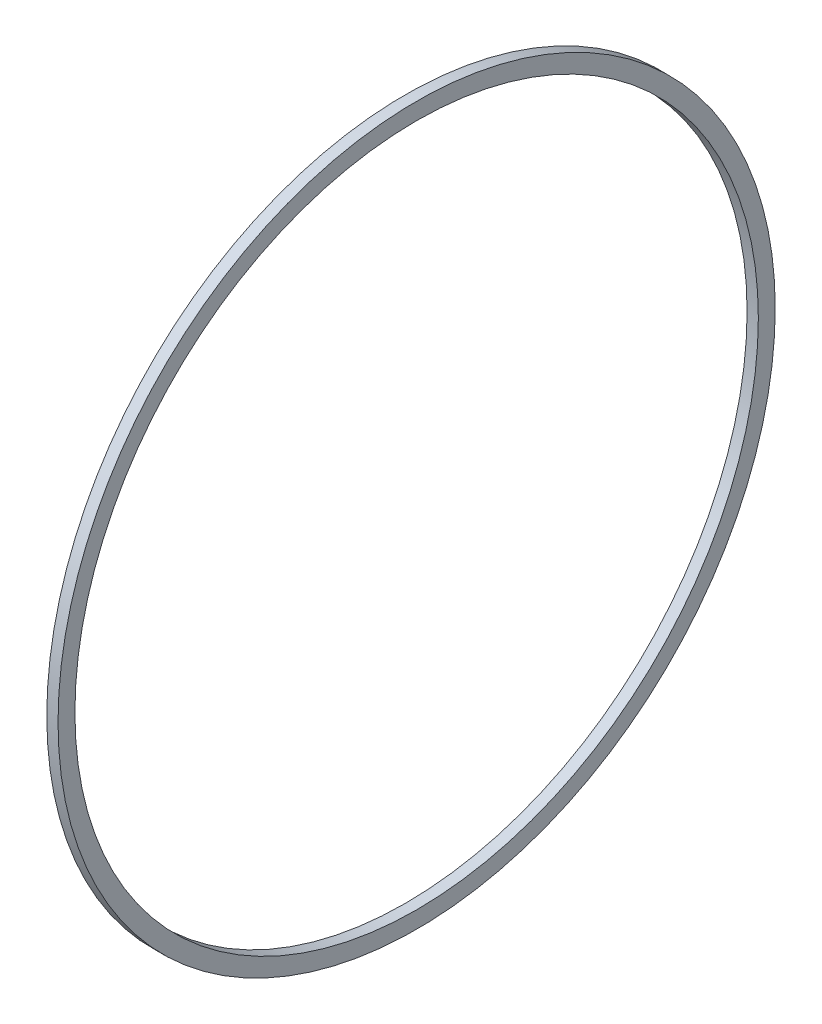
ISO-10303-21;
HEADER;
FILE_DESCRIPTION(('STEP AP214'),'2;1');
FILE_NAME('part.step','',(''),(''),'','','');
FILE_SCHEMA(('AUTOMOTIVE_DESIGN { 1 0 10303 214 1 1 1 1 }'));
ENDSEC;
DATA;
#1=APPLICATION_CONTEXT('core data for automotive mechanical design processes');
#2=APPLICATION_PROTOCOL_DEFINITION('international standard','automotive_design',2000,#1);
#3=PRODUCT_CONTEXT('',#1,'mechanical');
#4=PRODUCT('Part','Part','',(#3));
#5=PRODUCT_RELATED_PRODUCT_CATEGORY('part','',(#4));
#6=PRODUCT_DEFINITION_FORMATION('','',#4);
#7=PRODUCT_DEFINITION_CONTEXT('part definition',#1,'design');
#8=PRODUCT_DEFINITION('design','',#6,#7);
#9=PRODUCT_DEFINITION_SHAPE('','',#8);
#10=(LENGTH_UNIT() NAMED_UNIT(*) SI_UNIT(.MILLI.,.METRE.));
#11=(NAMED_UNIT(*) PLANE_ANGLE_UNIT() SI_UNIT($,.RADIAN.));
#12=(NAMED_UNIT(*) SI_UNIT($,.STERADIAN.) SOLID_ANGLE_UNIT());
#13=UNCERTAINTY_MEASURE_WITH_UNIT(LENGTH_MEASURE(1.E-05),#10,'distance_accuracy_value','');
#14=(GEOMETRIC_REPRESENTATION_CONTEXT(3) GLOBAL_UNCERTAINTY_ASSIGNED_CONTEXT((#13)) GLOBAL_UNIT_ASSIGNED_CONTEXT((#10,
#11,#12)) REPRESENTATION_CONTEXT('',''));
#15=CARTESIAN_POINT('',(0.,0.,0.));
#16=DIRECTION('',(0.,0.,1.));
#17=DIRECTION('',(1.,0.,0.));
#18=AXIS2_PLACEMENT_3D('',#15,#16,#17);
#19=CARTESIAN_POINT('',(2.,0.,0.));
#20=DIRECTION('',(1.,0.,0.));
#21=DIRECTION('',(0.,0.,-1.));
#22=AXIS2_PLACEMENT_3D('',#19,#20,#21);
#23=PLANE('',#22);
#24=CARTESIAN_POINT('',(2.,0.,0.));
#25=DIRECTION('',(1.,0.,0.));
#26=DIRECTION('',(0.,0.,-1.));
#27=AXIS2_PLACEMENT_3D('',#24,#25,#26);
#28=CIRCLE('',#27,63.75);
#29=CARTESIAN_POINT('',(2.,0.,-63.75));
#30=VERTEX_POINT('',#29);
#31=EDGE_CURVE('E10',#30,#30,#28,.T.);
#32=ORIENTED_EDGE('',*,*,#31,.T.);
#33=EDGE_LOOP('',(#32));
#34=FACE_BOUND('',#33,.T.);
#35=CARTESIAN_POINT('',(2.,0.,0.));
#36=DIRECTION('',(1.,0.,0.));
#37=DIRECTION('',(0.,0.,-1.));
#38=AXIS2_PLACEMENT_3D('',#35,#36,#37);
#39=CIRCLE('',#38,60.75);
#40=CARTESIAN_POINT('',(2.,0.,-60.75));
#41=VERTEX_POINT('',#40);
#42=EDGE_CURVE('E50',#41,#41,#39,.T.);
#43=ORIENTED_EDGE('',*,*,#42,.F.);
#44=EDGE_LOOP('',(#43));
#45=FACE_BOUND('',#44,.T.);
#46=ADVANCED_FACE('F37',(#34,#45),#23,.T.);
#47=CARTESIAN_POINT('',(0.,0.,0.));
#48=DIRECTION('',(1.,0.,0.));
#49=DIRECTION('',(0.,0.,-1.));
#50=AXIS2_PLACEMENT_3D('',#47,#48,#49);
#51=PLANE('',#50);
#52=CARTESIAN_POINT('',(0.,0.,0.));
#53=DIRECTION('',(1.,0.,0.));
#54=DIRECTION('',(0.,0.,-1.));
#55=AXIS2_PLACEMENT_3D('',#52,#53,#54);
#56=CIRCLE('',#55,63.75);
#57=CARTESIAN_POINT('',(0.,0.,-63.75));
#58=VERTEX_POINT('',#57);
#59=EDGE_CURVE('E41',#58,#58,#56,.T.);
#60=ORIENTED_EDGE('',*,*,#59,.F.);
#61=EDGE_LOOP('',(#60));
#62=FACE_BOUND('',#61,.T.);
#63=CARTESIAN_POINT('',(0.,0.,0.));
#64=DIRECTION('',(1.,0.,0.));
#65=DIRECTION('',(0.,0.,-1.));
#66=AXIS2_PLACEMENT_3D('',#63,#64,#65);
#67=CIRCLE('',#66,60.75);
#68=CARTESIAN_POINT('',(0.,0.,-60.75));
#69=VERTEX_POINT('',#68);
#70=EDGE_CURVE('E52',#69,#69,#67,.T.);
#71=ORIENTED_EDGE('',*,*,#70,.T.);
#72=EDGE_LOOP('',(#71));
#73=FACE_BOUND('',#72,.T.);
#74=ADVANCED_FACE('F64',(#62,#73),#51,.F.);
#75=CARTESIAN_POINT('',(2.,0.,0.));
#76=DIRECTION('',(-1.,0.,0.));
#77=DIRECTION('',(0.,0.,1.));
#78=AXIS2_PLACEMENT_3D('',#75,#76,#77);
#79=CYLINDRICAL_SURFACE('',#78,63.75);
#80=ORIENTED_EDGE('',*,*,#31,.F.);
#81=EDGE_LOOP('',(#80));
#82=FACE_BOUND('',#81,.T.);
#83=ORIENTED_EDGE('',*,*,#59,.T.);
#84=EDGE_LOOP('',(#83));
#85=FACE_BOUND('',#84,.T.);
#86=ADVANCED_FACE('F39',(#82,#85),#79,.T.);
#87=CARTESIAN_POINT('',(2.,0.,0.));
#88=DIRECTION('',(-1.,0.,0.));
#89=DIRECTION('',(0.,0.,1.));
#90=AXIS2_PLACEMENT_3D('',#87,#88,#89);
#91=CYLINDRICAL_SURFACE('',#90,60.75);
#92=ORIENTED_EDGE('',*,*,#42,.T.);
#93=EDGE_LOOP('',(#92));
#94=FACE_BOUND('',#93,.T.);
#95=ORIENTED_EDGE('',*,*,#70,.F.);
#96=EDGE_LOOP('',(#95));
#97=FACE_BOUND('',#96,.T.);
#98=ADVANCED_FACE('F60',(#94,#97),#91,.F.);
#99=CLOSED_SHELL('',(#46,#74,#86,#98));
#100=MANIFOLD_SOLID_BREP('B2',#99);
#101=ADVANCED_BREP_SHAPE_REPRESENTATION('',(#18,#100),#14);
#102=SHAPE_DEFINITION_REPRESENTATION(#9,#101);
ENDSEC;
END-ISO-10303-21;
